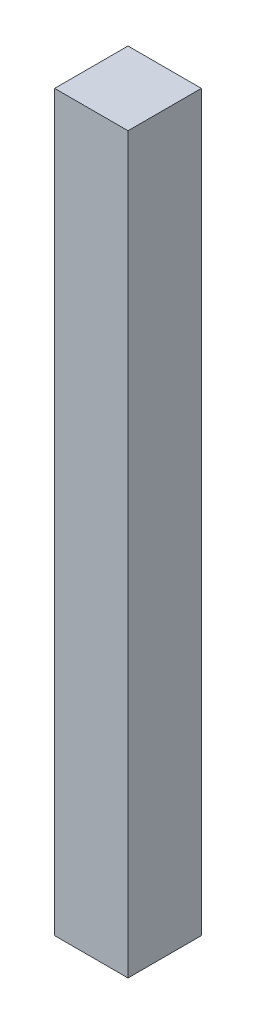
ISO-10303-21;
HEADER;
FILE_DESCRIPTION(('STEP AP214'),'2;1');
FILE_NAME('part.step','',(''),(''),'','','');
FILE_SCHEMA(('AUTOMOTIVE_DESIGN { 1 0 10303 214 1 1 1 1 }'));
ENDSEC;
DATA;
#1=APPLICATION_CONTEXT('core data for automotive mechanical design processes');
#2=APPLICATION_PROTOCOL_DEFINITION('international standard','automotive_design',2000,#1);
#3=PRODUCT_CONTEXT('',#1,'mechanical');
#4=PRODUCT('Part','Part','',(#3));
#5=PRODUCT_RELATED_PRODUCT_CATEGORY('part','',(#4));
#6=PRODUCT_DEFINITION_FORMATION('','',#4);
#7=PRODUCT_DEFINITION_CONTEXT('part definition',#1,'design');
#8=PRODUCT_DEFINITION('design','',#6,#7);
#9=PRODUCT_DEFINITION_SHAPE('','',#8);
#10=(LENGTH_UNIT() NAMED_UNIT(*) SI_UNIT(.MILLI.,.METRE.));
#11=(NAMED_UNIT(*) PLANE_ANGLE_UNIT() SI_UNIT($,.RADIAN.));
#12=(NAMED_UNIT(*) SI_UNIT($,.STERADIAN.) SOLID_ANGLE_UNIT());
#13=UNCERTAINTY_MEASURE_WITH_UNIT(LENGTH_MEASURE(1.E-05),#10,'distance_accuracy_value','');
#14=(GEOMETRIC_REPRESENTATION_CONTEXT(3) GLOBAL_UNCERTAINTY_ASSIGNED_CONTEXT((#13)) GLOBAL_UNIT_ASSIGNED_CONTEXT((#10,
#11,#12)) REPRESENTATION_CONTEXT('',''));
#15=CARTESIAN_POINT('',(0.,0.,0.));
#16=DIRECTION('',(0.,0.,1.));
#17=DIRECTION('',(1.,0.,0.));
#18=AXIS2_PLACEMENT_3D('',#15,#16,#17);
#19=CARTESIAN_POINT('',(0.,200.,0.));
#20=DIRECTION('',(1.,0.,0.));
#21=DIRECTION('',(0.,0.,-1.));
#22=AXIS2_PLACEMENT_3D('',#19,#20,#21);
#23=PLANE('',#22);
#24=DIRECTION('',(0.,0.,1.));
#25=VECTOR('',#24,1.);
#26=CARTESIAN_POINT('',(0.,0.,0.));
#27=LINE('',#26,#25);
#28=CARTESIAN_POINT('',(0.,0.,0.));
#29=VERTEX_POINT('',#28);
#30=CARTESIAN_POINT('',(0.,0.,20.));
#31=VERTEX_POINT('',#30);
#32=EDGE_CURVE('E96',#29,#31,#27,.T.);
#33=ORIENTED_EDGE('',*,*,#32,.T.);
#34=DIRECTION('',(0.,-1.,0.));
#35=VECTOR('',#34,1.);
#36=CARTESIAN_POINT('',(0.,200.,20.));
#37=LINE('',#36,#35);
#38=CARTESIAN_POINT('',(0.,200.,20.));
#39=VERTEX_POINT('',#38);
#40=EDGE_CURVE('E11',#39,#31,#37,.T.);
#41=ORIENTED_EDGE('',*,*,#40,.F.);
#42=DIRECTION('',(0.,0.,1.));
#43=VECTOR('',#42,1.);
#44=CARTESIAN_POINT('',(0.,200.,0.));
#45=LINE('',#44,#43);
#46=CARTESIAN_POINT('',(0.,200.,0.));
#47=VERTEX_POINT('',#46);
#48=EDGE_CURVE('E84',#47,#39,#45,.T.);
#49=ORIENTED_EDGE('',*,*,#48,.F.);
#50=DIRECTION('',(0.,-1.,0.));
#51=VECTOR('',#50,1.);
#52=CARTESIAN_POINT('',(0.,200.,0.));
#53=LINE('',#52,#51);
#54=EDGE_CURVE('E92',#47,#29,#53,.T.);
#55=ORIENTED_EDGE('',*,*,#54,.T.);
#56=EDGE_LOOP('',(#33,#41,#49,#55));
#57=FACE_BOUND('',#56,.T.);
#58=ADVANCED_FACE('F33',(#57),#23,.F.);
#59=CARTESIAN_POINT('',(0.,200.,20.));
#60=DIRECTION('',(0.,0.,-1.));
#61=DIRECTION('',(-1.,0.,0.));
#62=AXIS2_PLACEMENT_3D('',#59,#60,#61);
#63=PLANE('',#62);
#64=DIRECTION('',(1.,0.,0.));
#65=VECTOR('',#64,1.);
#66=CARTESIAN_POINT('',(0.,0.,20.));
#67=LINE('',#66,#65);
#68=CARTESIAN_POINT('',(20.,0.,20.));
#69=VERTEX_POINT('',#68);
#70=EDGE_CURVE('E88',#31,#69,#67,.T.);
#71=ORIENTED_EDGE('',*,*,#70,.T.);
#72=DIRECTION('',(0.,-1.,0.));
#73=VECTOR('',#72,1.);
#74=CARTESIAN_POINT('',(20.,200.,20.));
#75=LINE('',#74,#73);
#76=CARTESIAN_POINT('',(20.,200.,20.));
#77=VERTEX_POINT('',#76);
#78=EDGE_CURVE('E41',#77,#69,#75,.T.);
#79=ORIENTED_EDGE('',*,*,#78,.F.);
#80=DIRECTION('',(1.,0.,0.));
#81=VECTOR('',#80,1.);
#82=CARTESIAN_POINT('',(0.,200.,20.));
#83=LINE('',#82,#81);
#84=EDGE_CURVE('E79',#39,#77,#83,.T.);
#85=ORIENTED_EDGE('',*,*,#84,.F.);
#86=ORIENTED_EDGE('',*,*,#40,.T.);
#87=EDGE_LOOP('',(#71,#79,#85,#86));
#88=FACE_BOUND('',#87,.T.);
#89=ADVANCED_FACE('F87',(#88),#63,.F.);
#90=CARTESIAN_POINT('',(20.,200.,0.));
#91=DIRECTION('',(-1.,0.,0.));
#92=DIRECTION('',(0.,0.,1.));
#93=AXIS2_PLACEMENT_3D('',#90,#91,#92);
#94=PLANE('',#93);
#95=DIRECTION('',(0.,0.,-1.));
#96=VECTOR('',#95,1.);
#97=CARTESIAN_POINT('',(20.,0.,0.));
#98=LINE('',#97,#96);
#99=CARTESIAN_POINT('',(20.,0.,0.));
#100=VERTEX_POINT('',#99);
#101=EDGE_CURVE('E66',#69,#100,#98,.T.);
#102=ORIENTED_EDGE('',*,*,#101,.T.);
#103=DIRECTION('',(0.,-1.,0.));
#104=VECTOR('',#103,1.);
#105=CARTESIAN_POINT('',(20.,200.,0.));
#106=LINE('',#105,#104);
#107=CARTESIAN_POINT('',(20.,200.,0.));
#108=VERTEX_POINT('',#107);
#109=EDGE_CURVE('E89',#108,#100,#106,.T.);
#110=ORIENTED_EDGE('',*,*,#109,.F.);
#111=DIRECTION('',(0.,0.,-1.));
#112=VECTOR('',#111,1.);
#113=CARTESIAN_POINT('',(20.,200.,0.));
#114=LINE('',#113,#112);
#115=EDGE_CURVE('E82',#77,#108,#114,.T.);
#116=ORIENTED_EDGE('',*,*,#115,.F.);
#117=ORIENTED_EDGE('',*,*,#78,.T.);
#118=EDGE_LOOP('',(#102,#110,#116,#117));
#119=FACE_BOUND('',#118,.T.);
#120=ADVANCED_FACE('F90',(#119),#94,.F.);
#121=CARTESIAN_POINT('',(0.,200.,0.));
#122=DIRECTION('',(0.,0.,1.));
#123=DIRECTION('',(1.,0.,0.));
#124=AXIS2_PLACEMENT_3D('',#121,#122,#123);
#125=PLANE('',#124);
#126=DIRECTION('',(-1.,0.,0.));
#127=VECTOR('',#126,1.);
#128=CARTESIAN_POINT('',(0.,0.,0.));
#129=LINE('',#128,#127);
#130=EDGE_CURVE('E72',#100,#29,#129,.T.);
#131=ORIENTED_EDGE('',*,*,#130,.T.);
#132=ORIENTED_EDGE('',*,*,#54,.F.);
#133=DIRECTION('',(-1.,0.,0.));
#134=VECTOR('',#133,1.);
#135=CARTESIAN_POINT('',(0.,200.,0.));
#136=LINE('',#135,#134);
#137=EDGE_CURVE('E49',#108,#47,#136,.T.);
#138=ORIENTED_EDGE('',*,*,#137,.F.);
#139=ORIENTED_EDGE('',*,*,#109,.T.);
#140=EDGE_LOOP('',(#131,#132,#138,#139));
#141=FACE_BOUND('',#140,.T.);
#142=ADVANCED_FACE('F103',(#141),#125,.F.);
#143=CARTESIAN_POINT('',(0.,200.,0.));
#144=DIRECTION('',(0.,1.,0.));
#145=DIRECTION('',(0.,0.,1.));
#146=AXIS2_PLACEMENT_3D('',#143,#144,#145);
#147=PLANE('',#146);
#148=ORIENTED_EDGE('',*,*,#48,.T.);
#149=ORIENTED_EDGE('',*,*,#84,.T.);
#150=ORIENTED_EDGE('',*,*,#115,.T.);
#151=ORIENTED_EDGE('',*,*,#137,.T.);
#152=EDGE_LOOP('',(#148,#149,#150,#151));
#153=FACE_BOUND('',#152,.T.);
#154=ADVANCED_FACE('F80',(#153),#147,.T.);
#155=CARTESIAN_POINT('',(0.,0.,0.));
#156=DIRECTION('',(0.,1.,0.));
#157=DIRECTION('',(0.,0.,1.));
#158=AXIS2_PLACEMENT_3D('',#155,#156,#157);
#159=PLANE('',#158);
#160=ORIENTED_EDGE('',*,*,#32,.F.);
#161=ORIENTED_EDGE('',*,*,#130,.F.);
#162=ORIENTED_EDGE('',*,*,#101,.F.);
#163=ORIENTED_EDGE('',*,*,#70,.F.);
#164=EDGE_LOOP('',(#160,#161,#162,#163));
#165=FACE_BOUND('',#164,.T.);
#166=ADVANCED_FACE('F106',(#165),#159,.F.);
#167=CLOSED_SHELL('',(#58,#89,#120,#142,#154,#166));
#168=MANIFOLD_SOLID_BREP('B2',#167);
#169=ADVANCED_BREP_SHAPE_REPRESENTATION('',(#18,#168),#14);
#170=SHAPE_DEFINITION_REPRESENTATION(#9,#169);
ENDSEC;
END-ISO-10303-21;
